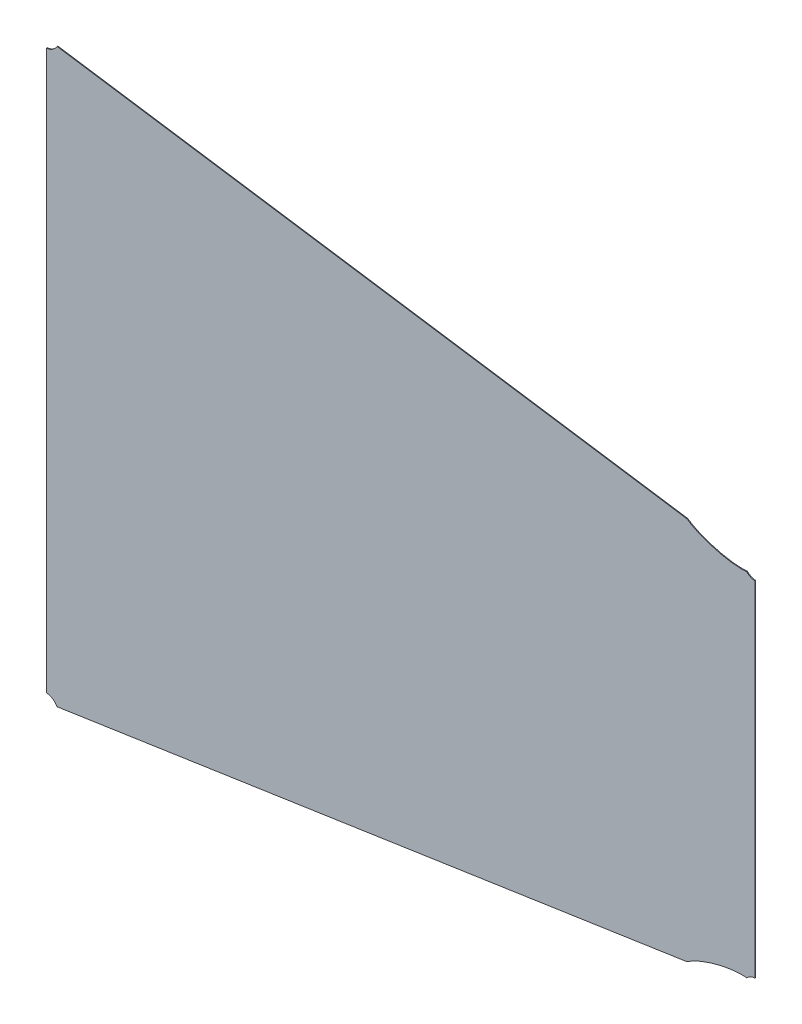
ISO-10303-21;
HEADER;
FILE_DESCRIPTION(('STEP AP214'),'2;1');
FILE_NAME('part.step','',(''),(''),'','','');
FILE_SCHEMA(('AUTOMOTIVE_DESIGN { 1 0 10303 214 1 1 1 1 }'));
ENDSEC;
DATA;
#1=APPLICATION_CONTEXT('core data for automotive mechanical design processes');
#2=APPLICATION_PROTOCOL_DEFINITION('international standard','automotive_design',2000,#1);
#3=PRODUCT_CONTEXT('',#1,'mechanical');
#4=PRODUCT('Part','Part','',(#3));
#5=PRODUCT_RELATED_PRODUCT_CATEGORY('part','',(#4));
#6=PRODUCT_DEFINITION_FORMATION('','',#4);
#7=PRODUCT_DEFINITION_CONTEXT('part definition',#1,'design');
#8=PRODUCT_DEFINITION('design','',#6,#7);
#9=PRODUCT_DEFINITION_SHAPE('','',#8);
#10=(LENGTH_UNIT() NAMED_UNIT(*) SI_UNIT(.MILLI.,.METRE.));
#11=(NAMED_UNIT(*) PLANE_ANGLE_UNIT() SI_UNIT($,.RADIAN.));
#12=(NAMED_UNIT(*) SI_UNIT($,.STERADIAN.) SOLID_ANGLE_UNIT());
#13=UNCERTAINTY_MEASURE_WITH_UNIT(LENGTH_MEASURE(1.E-05),#10,'distance_accuracy_value','');
#14=(GEOMETRIC_REPRESENTATION_CONTEXT(3) GLOBAL_UNCERTAINTY_ASSIGNED_CONTEXT((#13)) GLOBAL_UNIT_ASSIGNED_CONTEXT((#10,
#11,#12)) REPRESENTATION_CONTEXT('',''));
#15=CARTESIAN_POINT('',(0.,0.,0.));
#16=DIRECTION('',(0.,0.,1.));
#17=DIRECTION('',(1.,0.,0.));
#18=AXIS2_PLACEMENT_3D('',#15,#16,#17);
#19=CARTESIAN_POINT('',(-206.350638573451,178.234256298305,0.75));
#20=CARTESIAN_POINT('',(-206.752993703178,178.198264306051,0.75));
#21=CARTESIAN_POINT('',(-207.539928278392,178.13855666705,0.75));
#22=CARTESIAN_POINT('',(-209.266797180046,178.051541980678,0.75));
#23=CARTESIAN_POINT('',(-211.615353292728,178.018552884096,0.75));
#24=CARTESIAN_POINT('',(-214.778879333919,178.117030022051,0.75));
#25=CARTESIAN_POINT('',(-219.442272990701,178.458968650206,0.75));
#26=CARTESIAN_POINT('',(-226.083190988048,179.327493296143,0.75));
#27=CARTESIAN_POINT('',(-235.041515620995,181.174554613976,0.75));
#28=CARTESIAN_POINT('',(-244.401007092143,183.815912628712,0.75));
#29=CARTESIAN_POINT('',(-251.889719580371,186.553469871623,0.75));
#30=CARTESIAN_POINT('',(-257.317102506259,188.9302863917,0.75));
#31=CARTESIAN_POINT('',(-261.034871731189,190.768565715654,0.75));
#32=CARTESIAN_POINT('',(-263.783209224722,192.309993433672,0.75));
#33=CARTESIAN_POINT('',(-265.771886976757,193.543556646672,0.75));
#34=CARTESIAN_POINT('',(-266.665075006141,194.13748578452,0.75));
#35=CARTESIAN_POINT('',(-267.116374990472,194.449020240077,0.75));
#36=B_SPLINE_CURVE_WITH_KNOTS('',3,(#19,#20,#21,#22,#23,#24,#25,#26,#27,#28,#29,#30,#31,#32,#33,
#34,#35),.UNSPECIFIED.,.F.,.F.,(4,1,1,1,1,1,1,1,1,1,1,1,1,1,4),(0.00463877868772403,
0.0155975915660169,0.0265564044443098,0.0484740302008956,0.0703916559574815,0.0923092817140673,
0.136144533227239,0.179979784740411,0.223815036253582,0.267650287766754,0.28956791352334,
0.311485539279925,0.333403165036511,0.344361977914804,0.355320790793097),.UNSPECIFIED.);
#37=DIRECTION('',(0.,0.,-1.));
#38=VECTOR('',#37,1.);
#39=SURFACE_OF_LINEAR_EXTRUSION('',#36,#38);
#40=CARTESIAN_POINT('',(-206.350638573451,178.234256298305,0.));
#41=CARTESIAN_POINT('',(-206.752993703178,178.198264306051,0.));
#42=CARTESIAN_POINT('',(-207.539928278392,178.13855666705,0.));
#43=CARTESIAN_POINT('',(-209.266797180046,178.051541980678,0.));
#44=CARTESIAN_POINT('',(-211.615353292728,178.018552884096,0.));
#45=CARTESIAN_POINT('',(-214.778879333919,178.117030022051,0.));
#46=CARTESIAN_POINT('',(-219.442272990701,178.458968650206,0.));
#47=CARTESIAN_POINT('',(-226.083190988048,179.327493296143,0.));
#48=CARTESIAN_POINT('',(-235.041515620995,181.174554613976,0.));
#49=CARTESIAN_POINT('',(-244.401007092143,183.815912628712,0.));
#50=CARTESIAN_POINT('',(-251.889719580371,186.553469871623,0.));
#51=CARTESIAN_POINT('',(-257.317102506259,188.9302863917,0.));
#52=CARTESIAN_POINT('',(-261.034871731189,190.768565715654,0.));
#53=CARTESIAN_POINT('',(-263.783209224722,192.309993433672,0.));
#54=CARTESIAN_POINT('',(-265.771886976757,193.543556646672,0.));
#55=CARTESIAN_POINT('',(-266.665075006141,194.13748578452,0.));
#56=CARTESIAN_POINT('',(-267.116374990472,194.449020240077,0.));
#57=B_SPLINE_CURVE_WITH_KNOTS('',3,(#40,#41,#42,#43,#44,#45,#46,#47,#48,#49,#50,#51,#52,#53,#54,
#55,#56),.UNSPECIFIED.,.F.,.F.,(4,1,1,1,1,1,1,1,1,1,1,1,1,1,4),(0.00463877868772403,
0.0155975915660169,0.0265564044443098,0.0484740302008956,0.0703916559574815,0.0923092817140673,
0.136144533227239,0.179979784740411,0.223815036253582,0.267650287766754,0.28956791352334,
0.311485539279925,0.333403165036511,0.344361977914804,0.355320790793097),.UNSPECIFIED.);
#58=CARTESIAN_POINT('',(-206.350638573451,178.234256298305,0.));
#59=VERTEX_POINT('',#58);
#60=CARTESIAN_POINT('',(-267.116374990472,194.449020240077,0.));
#61=VERTEX_POINT('',#60);
#62=EDGE_CURVE('E150',#59,#61,#57,.T.);
#63=ORIENTED_EDGE('',*,*,#62,.T.);
#64=DIRECTION('',(0.,0.,-1.));
#65=VECTOR('',#64,1.);
#66=CARTESIAN_POINT('',(-267.116374990472,194.449020240077,0.75));
#67=LINE('',#66,#65);
#68=CARTESIAN_POINT('',(-267.116374990472,194.449020240077,0.75));
#69=VERTEX_POINT('',#68);
#70=EDGE_CURVE('E11',#69,#61,#67,.T.);
#71=ORIENTED_EDGE('',*,*,#70,.F.);
#72=CARTESIAN_POINT('',(-206.350638573451,178.234256298305,0.75));
#73=VERTEX_POINT('',#72);
#74=EDGE_CURVE('E213',#73,#69,#36,.T.);
#75=ORIENTED_EDGE('',*,*,#74,.F.);
#76=DIRECTION('',(0.,0.,-1.));
#77=VECTOR('',#76,1.);
#78=CARTESIAN_POINT('',(-206.350638573451,178.234256298305,0.75));
#79=LINE('',#78,#77);
#80=EDGE_CURVE('E140',#73,#59,#79,.T.);
#81=ORIENTED_EDGE('',*,*,#80,.T.);
#82=EDGE_LOOP('',(#63,#71,#75,#81));
#83=FACE_BOUND('',#82,.T.);
#84=ADVANCED_FACE('F35',(#83),#39,.F.);
#85=CARTESIAN_POINT('',(-267.116374990472,194.449020240077,0.75));
#86=DIRECTION('',(-0.147851118919845,-0.989009629191824,0.));
#87=DIRECTION('',(0.989009629191824,-0.147851118919845,0.));
#88=AXIS2_PLACEMENT_3D('',#85,#86,#87);
#89=PLANE('',#88);
#90=DIRECTION('',(-0.989009629191824,0.147851118919845,0.));
#91=VECTOR('',#90,1.);
#92=CARTESIAN_POINT('',(-267.116374990472,194.449020240077,0.));
#93=LINE('',#92,#91);
#94=CARTESIAN_POINT('',(-905.657427311754,289.907149539692,0.));
#95=VERTEX_POINT('',#94);
#96=EDGE_CURVE('E253',#61,#95,#93,.T.);
#97=ORIENTED_EDGE('',*,*,#96,.T.);
#98=DIRECTION('',(0.,0.,-1.));
#99=VECTOR('',#98,1.);
#100=CARTESIAN_POINT('',(-905.657427311754,289.907149539692,0.75));
#101=LINE('',#100,#99);
#102=CARTESIAN_POINT('',(-905.657427311754,289.907149539692,0.75));
#103=VERTEX_POINT('',#102);
#104=EDGE_CURVE('E44',#103,#95,#101,.T.);
#105=ORIENTED_EDGE('',*,*,#104,.F.);
#106=DIRECTION('',(-0.989009629191824,0.147851118919845,0.));
#107=VECTOR('',#106,1.);
#108=CARTESIAN_POINT('',(-267.116374990472,194.449020240077,0.75));
#109=LINE('',#108,#107);
#110=EDGE_CURVE('E101',#69,#103,#109,.T.);
#111=ORIENTED_EDGE('',*,*,#110,.F.);
#112=ORIENTED_EDGE('',*,*,#70,.T.);
#113=EDGE_LOOP('',(#97,#105,#111,#112));
#114=FACE_BOUND('',#113,.T.);
#115=ADVANCED_FACE('F203',(#114),#89,.F.);
#116=CARTESIAN_POINT('',(-905.657427311754,289.907149539692,0.75));
#117=CARTESIAN_POINT('',(-906.006104534684,289.315247267737,0.75));
#118=CARTESIAN_POINT('',(-906.804551958849,288.159312543313,0.75));
#119=CARTESIAN_POINT('',(-908.572469255554,286.249166575964,0.75));
#120=CARTESIAN_POINT('',(-911.015586005658,284.522093086331,0.75));
#121=CARTESIAN_POINT('',(-913.404414632564,283.603556477546,0.75));
#122=CARTESIAN_POINT('',(-915.194323394417,283.225046758427,0.75));
#123=CARTESIAN_POINT('',(-916.005259178187,283.136981023329,0.75));
#124=CARTESIAN_POINT('',(-916.423901621275,283.11129085984,0.75));
#125=B_SPLINE_CURVE_WITH_KNOTS('',3,(#116,#117,#118,#119,#120,#121,#122,#123,#124),
.UNSPECIFIED.,.F.,.F.,(4,1,1,1,1,1,4),(0.312267878003206,0.332062335536894,0.351856793070583,
0.39144570813796,0.431034623205337,0.450829080739025,0.470623538272714),.UNSPECIFIED.);
#126=DIRECTION('',(0.,0.,-1.));
#127=VECTOR('',#126,1.);
#128=SURFACE_OF_LINEAR_EXTRUSION('',#125,#127);
#129=CARTESIAN_POINT('',(-905.657427311754,289.907149539692,0.));
#130=CARTESIAN_POINT('',(-906.006104534684,289.315247267737,0.));
#131=CARTESIAN_POINT('',(-906.804551958849,288.159312543313,0.));
#132=CARTESIAN_POINT('',(-908.572469255554,286.249166575964,0.));
#133=CARTESIAN_POINT('',(-911.015586005658,284.522093086331,0.));
#134=CARTESIAN_POINT('',(-913.404414632564,283.603556477546,0.));
#135=CARTESIAN_POINT('',(-915.194323394417,283.225046758427,0.));
#136=CARTESIAN_POINT('',(-916.005259178187,283.136981023329,0.));
#137=CARTESIAN_POINT('',(-916.423901621275,283.11129085984,0.));
#138=B_SPLINE_CURVE_WITH_KNOTS('',3,(#129,#130,#131,#132,#133,#134,#135,#136,#137),
.UNSPECIFIED.,.F.,.F.,(4,1,1,1,1,1,4),(0.312267878003206,0.332062335536894,0.351856793070583,
0.39144570813796,0.431034623205337,0.450829080739025,0.470623538272714),.UNSPECIFIED.);
#139=CARTESIAN_POINT('',(-916.423901621275,283.11129085984,0.));
#140=VERTEX_POINT('',#139);
#141=EDGE_CURVE('E249',#95,#140,#138,.T.);
#142=ORIENTED_EDGE('',*,*,#141,.T.);
#143=DIRECTION('',(0.,0.,-1.));
#144=VECTOR('',#143,1.);
#145=CARTESIAN_POINT('',(-916.423901621275,283.11129085984,0.75));
#146=LINE('',#145,#144);
#147=CARTESIAN_POINT('',(-916.423901621275,283.11129085984,0.75));
#148=VERTEX_POINT('',#147);
#149=EDGE_CURVE('E243',#148,#140,#146,.T.);
#150=ORIENTED_EDGE('',*,*,#149,.F.);
#151=EDGE_CURVE('E205',#103,#148,#125,.T.);
#152=ORIENTED_EDGE('',*,*,#151,.F.);
#153=ORIENTED_EDGE('',*,*,#104,.T.);
#154=EDGE_LOOP('',(#142,#150,#152,#153));
#155=FACE_BOUND('',#154,.T.);
#156=ADVANCED_FACE('F200',(#155),#128,.F.);
#157=CARTESIAN_POINT('',(-916.423901621275,283.11129085984,0.75));
#158=DIRECTION('',(1.,0.,0.));
#159=DIRECTION('',(0.,1.,0.));
#160=AXIS2_PLACEMENT_3D('',#157,#158,#159);
#161=PLANE('',#160);
#162=DIRECTION('',(0.,-1.,0.));
#163=VECTOR('',#162,1.);
#164=CARTESIAN_POINT('',(-916.423901621275,283.11129085984,0.));
#165=LINE('',#164,#163);
#166=CARTESIAN_POINT('',(-916.423901621275,-283.111290859833,0.));
#167=VERTEX_POINT('',#166);
#168=EDGE_CURVE('E255',#140,#167,#165,.T.);
#169=ORIENTED_EDGE('',*,*,#168,.T.);
#170=DIRECTION('',(0.,0.,-1.));
#171=VECTOR('',#170,1.);
#172=CARTESIAN_POINT('',(-916.423901621275,-283.111290859833,0.75));
#173=LINE('',#172,#171);
#174=CARTESIAN_POINT('',(-916.423901621275,-283.111290859833,0.75));
#175=VERTEX_POINT('',#174);
#176=EDGE_CURVE('E240',#175,#167,#173,.T.);
#177=ORIENTED_EDGE('',*,*,#176,.F.);
#178=DIRECTION('',(0.,-1.,0.));
#179=VECTOR('',#178,1.);
#180=CARTESIAN_POINT('',(-916.423901621275,283.11129085984,0.75));
#181=LINE('',#180,#179);
#182=EDGE_CURVE('E188',#148,#175,#181,.T.);
#183=ORIENTED_EDGE('',*,*,#182,.F.);
#184=ORIENTED_EDGE('',*,*,#149,.T.);
#185=EDGE_LOOP('',(#169,#177,#183,#184));
#186=FACE_BOUND('',#185,.T.);
#187=ADVANCED_FACE('F196',(#186),#161,.F.);
#188=CARTESIAN_POINT('',(-916.423901621275,-283.111290859833,0.75));
#189=CARTESIAN_POINT('',(-916.005259178186,-283.13698102332,0.75));
#190=CARTESIAN_POINT('',(-915.194323394417,-283.225046758416,0.75));
#191=CARTESIAN_POINT('',(-913.404414632564,-283.603556477529,0.75));
#192=CARTESIAN_POINT('',(-911.015586005655,-284.522093086307,0.75));
#193=CARTESIAN_POINT('',(-908.572469255547,-286.24916657593,0.75));
#194=CARTESIAN_POINT('',(-906.804551958836,-288.159312543273,0.75));
#195=CARTESIAN_POINT('',(-906.006104534668,-289.315247267693,0.75));
#196=CARTESIAN_POINT('',(-905.657427311736,-289.907149539647,0.75));
#197=B_SPLINE_CURVE_WITH_KNOTS('',3,(#188,#189,#190,#191,#192,#193,#194,#195,#196),
.UNSPECIFIED.,.F.,.F.,(4,1,1,1,1,1,4),(0.0293764617273989,0.0491709192610748,0.0689653767947506,
0.108554291862102,0.148143206929454,0.16793766446313,0.187732121996806),.UNSPECIFIED.);
#198=DIRECTION('',(0.,0.,-1.));
#199=VECTOR('',#198,1.);
#200=SURFACE_OF_LINEAR_EXTRUSION('',#197,#199);
#201=CARTESIAN_POINT('',(-916.423901621275,-283.111290859833,0.));
#202=CARTESIAN_POINT('',(-916.005259178186,-283.13698102332,0.));
#203=CARTESIAN_POINT('',(-915.194323394417,-283.225046758416,0.));
#204=CARTESIAN_POINT('',(-913.404414632564,-283.603556477529,0.));
#205=CARTESIAN_POINT('',(-911.015586005655,-284.522093086307,0.));
#206=CARTESIAN_POINT('',(-908.572469255547,-286.24916657593,0.));
#207=CARTESIAN_POINT('',(-906.804551958836,-288.159312543273,0.));
#208=CARTESIAN_POINT('',(-906.006104534668,-289.315247267693,0.));
#209=CARTESIAN_POINT('',(-905.657427311736,-289.907149539647,0.));
#210=B_SPLINE_CURVE_WITH_KNOTS('',3,(#201,#202,#203,#204,#205,#206,#207,#208,#209),
.UNSPECIFIED.,.F.,.F.,(4,1,1,1,1,1,4),(0.0293764617273989,0.0491709192610748,0.0689653767947506,
0.108554291862102,0.148143206929454,0.16793766446313,0.187732121996806),.UNSPECIFIED.);
#211=CARTESIAN_POINT('',(-905.657427311736,-289.907149539647,0.));
#212=VERTEX_POINT('',#211);
#213=EDGE_CURVE('E257',#167,#212,#210,.T.);
#214=ORIENTED_EDGE('',*,*,#213,.T.);
#215=DIRECTION('',(0.,0.,-1.));
#216=VECTOR('',#215,1.);
#217=CARTESIAN_POINT('',(-905.657427311736,-289.907149539647,0.75));
#218=LINE('',#217,#216);
#219=CARTESIAN_POINT('',(-905.657427311736,-289.907149539647,0.75));
#220=VERTEX_POINT('',#219);
#221=EDGE_CURVE('E237',#220,#212,#218,.T.);
#222=ORIENTED_EDGE('',*,*,#221,.F.);
#223=EDGE_CURVE('E183',#175,#220,#197,.T.);
#224=ORIENTED_EDGE('',*,*,#223,.F.);
#225=ORIENTED_EDGE('',*,*,#176,.T.);
#226=EDGE_LOOP('',(#214,#222,#224,#225));
#227=FACE_BOUND('',#226,.T.);
#228=ADVANCED_FACE('F193',(#227),#200,.F.);
#229=CARTESIAN_POINT('',(-905.657427311736,-289.907149539647,0.75));
#230=DIRECTION('',(-0.147851118919843,0.989009629191824,0.));
#231=DIRECTION('',(-0.989009629191825,-0.147851118919843,0.));
#232=AXIS2_PLACEMENT_3D('',#229,#230,#231);
#233=PLANE('',#232);
#234=DIRECTION('',(0.989009629191825,0.147851118919843,0.));
#235=VECTOR('',#234,1.);
#236=CARTESIAN_POINT('',(-905.657427311736,-289.907149539647,0.));
#237=LINE('',#236,#235);
#238=CARTESIAN_POINT('',(-267.116374990422,-194.449020240029,0.));
#239=VERTEX_POINT('',#238);
#240=EDGE_CURVE('E268',#212,#239,#237,.T.);
#241=ORIENTED_EDGE('',*,*,#240,.T.);
#242=DIRECTION('',(0.,0.,-1.));
#243=VECTOR('',#242,1.);
#244=CARTESIAN_POINT('',(-267.116374990422,-194.449020240029,0.75));
#245=LINE('',#244,#243);
#246=CARTESIAN_POINT('',(-267.116374990422,-194.449020240029,0.75));
#247=VERTEX_POINT('',#246);
#248=EDGE_CURVE('E234',#247,#239,#245,.T.);
#249=ORIENTED_EDGE('',*,*,#248,.F.);
#250=DIRECTION('',(0.989009629191825,0.147851118919843,0.));
#251=VECTOR('',#250,1.);
#252=CARTESIAN_POINT('',(-905.657427311736,-289.907149539647,0.75));
#253=LINE('',#252,#251);
#254=EDGE_CURVE('E178',#220,#247,#253,.T.);
#255=ORIENTED_EDGE('',*,*,#254,.F.);
#256=ORIENTED_EDGE('',*,*,#221,.T.);
#257=EDGE_LOOP('',(#241,#249,#255,#256));
#258=FACE_BOUND('',#257,.T.);
#259=ADVANCED_FACE('F171',(#258),#233,.F.);
#260=CARTESIAN_POINT('',(-267.116374990422,-194.449020240029,0.75));
#261=CARTESIAN_POINT('',(-266.665075006092,-194.137485784471,0.75));
#262=CARTESIAN_POINT('',(-265.771886976706,-193.543556646624,0.75));
#263=CARTESIAN_POINT('',(-263.783209224671,-192.309993433623,0.75));
#264=CARTESIAN_POINT('',(-261.034871731137,-190.768565715606,0.75));
#265=CARTESIAN_POINT('',(-257.317102506207,-188.930286391653,0.75));
#266=CARTESIAN_POINT('',(-251.889719580318,-186.553469871577,0.75));
#267=CARTESIAN_POINT('',(-244.401007092091,-183.815912628667,0.75));
#268=CARTESIAN_POINT('',(-235.041515620945,-181.174554613933,0.75));
#269=CARTESIAN_POINT('',(-226.083190988002,-179.327493296101,0.75));
#270=CARTESIAN_POINT('',(-219.442272990657,-178.458968650164,0.75));
#271=CARTESIAN_POINT('',(-214.778879333876,-178.11703002201,0.75));
#272=CARTESIAN_POINT('',(-211.615353292686,-178.018552884055,0.75));
#273=CARTESIAN_POINT('',(-209.266797180005,-178.051541980637,0.75));
#274=CARTESIAN_POINT('',(-207.539928278352,-178.138556667009,0.75));
#275=CARTESIAN_POINT('',(-206.752993703137,-178.19826430601,0.75));
#276=CARTESIAN_POINT('',(-206.350638573411,-178.234256298264,0.75));
#277=B_SPLINE_CURVE_WITH_KNOTS('',3,(#260,#261,#262,#263,#264,#265,#266,#267,#268,#269,#270,
#271,#272,#273,#274,#275,#276),.UNSPECIFIED.,.F.,.F.,(4,1,1,1,1,1,1,1,1,1,1,1,1,1,4),
(0.644679209206995,0.655638022085285,0.666596834963576,0.688514460720157,0.710432086476738,
0.73234971223332,0.776184963746482,0.820020215259645,0.863855466772807,0.90769071828597,
0.929608344042551,0.951525969799133,0.973443595555714,0.984402408434004,0.995361221312295),.UNSPECIFIED.);
#278=DIRECTION('',(0.,0.,-1.));
#279=VECTOR('',#278,1.);
#280=SURFACE_OF_LINEAR_EXTRUSION('',#277,#279);
#281=CARTESIAN_POINT('',(-267.116374990422,-194.449020240029,0.));
#282=CARTESIAN_POINT('',(-266.665075006092,-194.137485784471,0.));
#283=CARTESIAN_POINT('',(-265.771886976706,-193.543556646624,0.));
#284=CARTESIAN_POINT('',(-263.783209224671,-192.309993433623,0.));
#285=CARTESIAN_POINT('',(-261.034871731137,-190.768565715606,0.));
#286=CARTESIAN_POINT('',(-257.317102506207,-188.930286391653,0.));
#287=CARTESIAN_POINT('',(-251.889719580318,-186.553469871577,0.));
#288=CARTESIAN_POINT('',(-244.401007092091,-183.815912628667,0.));
#289=CARTESIAN_POINT('',(-235.041515620945,-181.174554613933,0.));
#290=CARTESIAN_POINT('',(-226.083190988002,-179.327493296101,0.));
#291=CARTESIAN_POINT('',(-219.442272990657,-178.458968650164,0.));
#292=CARTESIAN_POINT('',(-214.778879333876,-178.11703002201,0.));
#293=CARTESIAN_POINT('',(-211.615353292686,-178.018552884055,0.));
#294=CARTESIAN_POINT('',(-209.266797180005,-178.051541980637,0.));
#295=CARTESIAN_POINT('',(-207.539928278352,-178.138556667009,0.));
#296=CARTESIAN_POINT('',(-206.752993703137,-178.19826430601,0.));
#297=CARTESIAN_POINT('',(-206.350638573411,-178.234256298264,0.));
#298=B_SPLINE_CURVE_WITH_KNOTS('',3,(#281,#282,#283,#284,#285,#286,#287,#288,#289,#290,#291,
#292,#293,#294,#295,#296,#297),.UNSPECIFIED.,.F.,.F.,(4,1,1,1,1,1,1,1,1,1,1,1,1,1,4),
(0.644679209206995,0.655638022085285,0.666596834963576,0.688514460720157,0.710432086476738,
0.73234971223332,0.776184963746482,0.820020215259645,0.863855466772807,0.90769071828597,
0.929608344042551,0.951525969799133,0.973443595555714,0.984402408434004,0.995361221312295),.UNSPECIFIED.);
#299=CARTESIAN_POINT('',(-206.350638573411,-178.234256298264,0.));
#300=VERTEX_POINT('',#299);
#301=EDGE_CURVE('E273',#239,#300,#298,.T.);
#302=ORIENTED_EDGE('',*,*,#301,.T.);
#303=DIRECTION('',(0.,0.,-1.));
#304=VECTOR('',#303,1.);
#305=CARTESIAN_POINT('',(-206.350638573411,-178.234256298264,0.75));
#306=LINE('',#305,#304);
#307=CARTESIAN_POINT('',(-206.350638573411,-178.234256298264,0.75));
#308=VERTEX_POINT('',#307);
#309=EDGE_CURVE('E135',#308,#300,#306,.T.);
#310=ORIENTED_EDGE('',*,*,#309,.F.);
#311=EDGE_CURVE('E126',#247,#308,#277,.T.);
#312=ORIENTED_EDGE('',*,*,#311,.F.);
#313=ORIENTED_EDGE('',*,*,#248,.T.);
#314=EDGE_LOOP('',(#302,#310,#312,#313));
#315=FACE_BOUND('',#314,.T.);
#316=ADVANCED_FACE('F168',(#315),#280,.F.);
#317=CARTESIAN_POINT('',(-206.350638573411,-178.234256298264,0.75));
#318=CARTESIAN_POINT('',(-206.016868943763,-177.898350741914,0.75));
#319=CARTESIAN_POINT('',(-205.297190597378,-177.249011775433,0.75));
#320=CARTESIAN_POINT('',(-203.861424394291,-176.203690635803,0.75));
#321=CARTESIAN_POINT('',(-202.057107028886,-175.259966245289,0.75));
#322=CARTESIAN_POINT('',(-200.029378533851,-174.610462195869,0.75));
#323=CARTESIAN_POINT('',(-198.814001088208,-174.406171048632,0.75));
#324=CARTESIAN_POINT('',(-198.180056234935,-174.34337138151,0.75));
#325=B_SPLINE_CURVE_WITH_KNOTS('',3,(#317,#318,#319,#320,#321,#322,#323,#324),.UNSPECIFIED.,.F.,
.F.,(4,1,1,1,1,4),(0.379343872971168,0.396436374128907,0.413528875286646,0.447713877602124,
0.481898879917602,0.51608388223308),.UNSPECIFIED.);
#326=DIRECTION('',(0.,0.,-1.));
#327=VECTOR('',#326,1.);
#328=SURFACE_OF_LINEAR_EXTRUSION('',#325,#327);
#329=CARTESIAN_POINT('',(-206.350638573411,-178.234256298264,0.));
#330=CARTESIAN_POINT('',(-206.016868943763,-177.898350741914,0.));
#331=CARTESIAN_POINT('',(-205.297190597378,-177.249011775433,0.));
#332=CARTESIAN_POINT('',(-203.861424394291,-176.203690635803,0.));
#333=CARTESIAN_POINT('',(-202.057107028886,-175.259966245289,0.));
#334=CARTESIAN_POINT('',(-200.029378533851,-174.610462195869,0.));
#335=CARTESIAN_POINT('',(-198.814001088208,-174.406171048632,0.));
#336=CARTESIAN_POINT('',(-198.180056234935,-174.34337138151,0.));
#337=B_SPLINE_CURVE_WITH_KNOTS('',3,(#329,#330,#331,#332,#333,#334,#335,#336),.UNSPECIFIED.,.F.,
.F.,(4,1,1,1,1,4),(0.379343872971168,0.396436374128907,0.413528875286646,0.447713877602124,
0.481898879917602,0.51608388223308),.UNSPECIFIED.);
#338=CARTESIAN_POINT('',(-198.180056234935,-174.34337138151,0.));
#339=VERTEX_POINT('',#338);
#340=EDGE_CURVE('E134',#300,#339,#337,.T.);
#341=ORIENTED_EDGE('',*,*,#340,.T.);
#342=DIRECTION('',(0.,0.,-1.));
#343=VECTOR('',#342,1.);
#344=CARTESIAN_POINT('',(-198.180056234935,-174.34337138151,0.75));
#345=LINE('',#344,#343);
#346=CARTESIAN_POINT('',(-198.180056234935,-174.34337138151,0.75));
#347=VERTEX_POINT('',#346);
#348=EDGE_CURVE('E131',#347,#339,#345,.T.);
#349=ORIENTED_EDGE('',*,*,#348,.F.);
#350=EDGE_CURVE('E120',#308,#347,#325,.T.);
#351=ORIENTED_EDGE('',*,*,#350,.F.);
#352=ORIENTED_EDGE('',*,*,#309,.T.);
#353=EDGE_LOOP('',(#341,#349,#351,#352));
#354=FACE_BOUND('',#353,.T.);
#355=ADVANCED_FACE('F132',(#354),#328,.F.);
#356=CARTESIAN_POINT('',(-198.180056234935,-174.34337138151,0.75));
#357=DIRECTION('',(-1.,0.,0.));
#358=DIRECTION('',(0.,-1.,0.));
#359=AXIS2_PLACEMENT_3D('',#356,#357,#358);
#360=PLANE('',#359);
#361=DIRECTION('',(0.,1.,0.));
#362=VECTOR('',#361,1.);
#363=CARTESIAN_POINT('',(-198.180056234935,-174.34337138151,0.));
#364=LINE('',#363,#362);
#365=CARTESIAN_POINT('',(-198.180056234935,174.34337138152,0.));
#366=VERTEX_POINT('',#365);
#367=EDGE_CURVE('E87',#339,#366,#364,.T.);
#368=ORIENTED_EDGE('',*,*,#367,.T.);
#369=DIRECTION('',(0.,0.,-1.));
#370=VECTOR('',#369,1.);
#371=CARTESIAN_POINT('',(-198.180056234935,174.34337138152,0.75));
#372=LINE('',#371,#370);
#373=CARTESIAN_POINT('',(-198.180056234935,174.34337138152,0.75));
#374=VERTEX_POINT('',#373);
#375=EDGE_CURVE('E136',#374,#366,#372,.T.);
#376=ORIENTED_EDGE('',*,*,#375,.F.);
#377=DIRECTION('',(0.,1.,0.));
#378=VECTOR('',#377,1.);
#379=CARTESIAN_POINT('',(-198.180056234935,-174.34337138151,0.75));
#380=LINE('',#379,#378);
#381=EDGE_CURVE('E124',#347,#374,#380,.T.);
#382=ORIENTED_EDGE('',*,*,#381,.F.);
#383=ORIENTED_EDGE('',*,*,#348,.T.);
#384=EDGE_LOOP('',(#368,#376,#382,#383));
#385=FACE_BOUND('',#384,.T.);
#386=ADVANCED_FACE('F138',(#385),#360,.F.);
#387=CARTESIAN_POINT('',(-198.180056234935,174.34337138152,0.75));
#388=CARTESIAN_POINT('',(-198.814001088211,174.406171048642,0.75));
#389=CARTESIAN_POINT('',(-200.029378533859,174.610462195879,0.75));
#390=CARTESIAN_POINT('',(-202.057107028905,175.259966245303,0.75));
#391=CARTESIAN_POINT('',(-203.86142439432,176.203690635825,0.75));
#392=CARTESIAN_POINT('',(-205.297190597414,177.249011775464,0.75));
#393=CARTESIAN_POINT('',(-206.016868943802,177.898350741951,0.75));
#394=CARTESIAN_POINT('',(-206.350638573451,178.234256298305,0.75));
#395=B_SPLINE_CURVE_WITH_KNOTS('',3,(#387,#388,#389,#390,#391,#392,#393,#394),.UNSPECIFIED.,.F.,
.F.,(4,1,1,1,1,4),(0.983916117767024,1.01810112008265,1.05228612239827,1.08647112471389,
1.1035636258717,1.12065612702951),.UNSPECIFIED.);
#396=DIRECTION('',(0.,0.,-1.));
#397=VECTOR('',#396,1.);
#398=SURFACE_OF_LINEAR_EXTRUSION('',#395,#397);
#399=CARTESIAN_POINT('',(-198.180056234935,174.34337138152,0.));
#400=CARTESIAN_POINT('',(-198.814001088211,174.406171048642,0.));
#401=CARTESIAN_POINT('',(-200.029378533859,174.610462195879,0.));
#402=CARTESIAN_POINT('',(-202.057107028905,175.259966245303,0.));
#403=CARTESIAN_POINT('',(-203.86142439432,176.203690635825,0.));
#404=CARTESIAN_POINT('',(-205.297190597414,177.249011775464,0.));
#405=CARTESIAN_POINT('',(-206.016868943802,177.898350741951,0.));
#406=CARTESIAN_POINT('',(-206.350638573451,178.234256298305,0.));
#407=B_SPLINE_CURVE_WITH_KNOTS('',3,(#399,#400,#401,#402,#403,#404,#405,#406),.UNSPECIFIED.,.F.,
.F.,(4,1,1,1,1,4),(0.983916117767024,1.01810112008265,1.05228612239827,1.08647112471389,
1.1035636258717,1.12065612702951),.UNSPECIFIED.);
#408=EDGE_CURVE('E93',#366,#59,#407,.T.);
#409=ORIENTED_EDGE('',*,*,#408,.T.);
#410=ORIENTED_EDGE('',*,*,#80,.F.);
#411=EDGE_CURVE('E52',#374,#73,#395,.T.);
#412=ORIENTED_EDGE('',*,*,#411,.F.);
#413=ORIENTED_EDGE('',*,*,#375,.T.);
#414=EDGE_LOOP('',(#409,#410,#412,#413));
#415=FACE_BOUND('',#414,.T.);
#416=ADVANCED_FACE('F158',(#415),#398,.F.);
#417=CARTESIAN_POINT('',(-235.108376760695,181.306937396794,0.75));
#418=DIRECTION('',(0.,0.,1.));
#419=DIRECTION('',(1.,0.,0.));
#420=AXIS2_PLACEMENT_3D('',#417,#418,#419);
#421=PLANE('',#420);
#422=ORIENTED_EDGE('',*,*,#74,.T.);
#423=ORIENTED_EDGE('',*,*,#110,.T.);
#424=ORIENTED_EDGE('',*,*,#151,.T.);
#425=ORIENTED_EDGE('',*,*,#182,.T.);
#426=ORIENTED_EDGE('',*,*,#223,.T.);
#427=ORIENTED_EDGE('',*,*,#254,.T.);
#428=ORIENTED_EDGE('',*,*,#311,.T.);
#429=ORIENTED_EDGE('',*,*,#350,.T.);
#430=ORIENTED_EDGE('',*,*,#381,.T.);
#431=ORIENTED_EDGE('',*,*,#411,.T.);
#432=EDGE_LOOP('',(#422,#423,#424,#425,#426,#427,#428,#429,#430,#431));
#433=FACE_BOUND('',#432,.T.);
#434=ADVANCED_FACE('F122',(#433),#421,.T.);
#435=CARTESIAN_POINT('',(-235.108376760695,181.306937396794,0.));
#436=DIRECTION('',(0.,0.,1.));
#437=DIRECTION('',(1.,0.,0.));
#438=AXIS2_PLACEMENT_3D('',#435,#436,#437);
#439=PLANE('',#438);
#440=ORIENTED_EDGE('',*,*,#62,.F.);
#441=ORIENTED_EDGE('',*,*,#408,.F.);
#442=ORIENTED_EDGE('',*,*,#367,.F.);
#443=ORIENTED_EDGE('',*,*,#340,.F.);
#444=ORIENTED_EDGE('',*,*,#301,.F.);
#445=ORIENTED_EDGE('',*,*,#240,.F.);
#446=ORIENTED_EDGE('',*,*,#213,.F.);
#447=ORIENTED_EDGE('',*,*,#168,.F.);
#448=ORIENTED_EDGE('',*,*,#141,.F.);
#449=ORIENTED_EDGE('',*,*,#96,.F.);
#450=EDGE_LOOP('',(#440,#441,#442,#443,#444,#445,#446,#447,#448,#449));
#451=FACE_BOUND('',#450,.T.);
#452=ADVANCED_FACE('F162',(#451),#439,.F.);
#453=CLOSED_SHELL('',(#84,#115,#156,#187,#228,#259,#316,#355,#386,#416,#434,#452));
#454=MANIFOLD_SOLID_BREP('B2',#453);
#455=ADVANCED_BREP_SHAPE_REPRESENTATION('',(#18,#454),#14);
#456=SHAPE_DEFINITION_REPRESENTATION(#9,#455);
ENDSEC;
END-ISO-10303-21;
